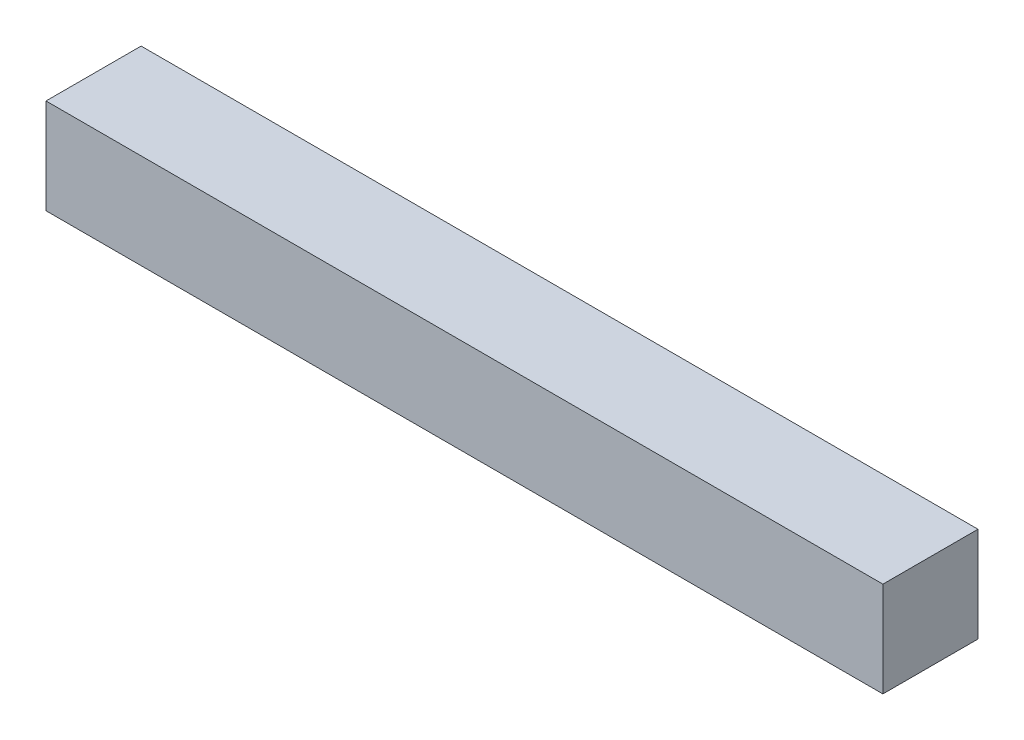
ISO-10303-21;
HEADER;
FILE_DESCRIPTION(('STEP AP214'),'2;1');
FILE_NAME('part.step','',(''),(''),'','','');
FILE_SCHEMA(('AUTOMOTIVE_DESIGN { 1 0 10303 214 1 1 1 1 }'));
ENDSEC;
DATA;
#1=APPLICATION_CONTEXT('core data for automotive mechanical design processes');
#2=APPLICATION_PROTOCOL_DEFINITION('international standard','automotive_design',2000,#1);
#3=PRODUCT_CONTEXT('',#1,'mechanical');
#4=PRODUCT('Part','Part','',(#3));
#5=PRODUCT_RELATED_PRODUCT_CATEGORY('part','',(#4));
#6=PRODUCT_DEFINITION_FORMATION('','',#4);
#7=PRODUCT_DEFINITION_CONTEXT('part definition',#1,'design');
#8=PRODUCT_DEFINITION('design','',#6,#7);
#9=PRODUCT_DEFINITION_SHAPE('','',#8);
#10=(LENGTH_UNIT() NAMED_UNIT(*) SI_UNIT(.MILLI.,.METRE.));
#11=(NAMED_UNIT(*) PLANE_ANGLE_UNIT() SI_UNIT($,.RADIAN.));
#12=(NAMED_UNIT(*) SI_UNIT($,.STERADIAN.) SOLID_ANGLE_UNIT());
#13=UNCERTAINTY_MEASURE_WITH_UNIT(LENGTH_MEASURE(1.E-05),#10,'distance_accuracy_value','');
#14=(GEOMETRIC_REPRESENTATION_CONTEXT(3) GLOBAL_UNCERTAINTY_ASSIGNED_CONTEXT((#13)) GLOBAL_UNIT_ASSIGNED_CONTEXT((#10,
#11,#12)) REPRESENTATION_CONTEXT('',''));
#15=CARTESIAN_POINT('',(0.,0.,0.));
#16=DIRECTION('',(0.,0.,1.));
#17=DIRECTION('',(1.,0.,0.));
#18=AXIS2_PLACEMENT_3D('',#15,#16,#17);
#19=CARTESIAN_POINT('',(220.,-25.,50.));
#20=DIRECTION('',(-1.,0.,0.));
#21=DIRECTION('',(0.,0.,1.));
#22=AXIS2_PLACEMENT_3D('',#19,#20,#21);
#23=PLANE('',#22);
#24=DIRECTION('',(0.,1.,0.));
#25=VECTOR('',#24,1.);
#26=CARTESIAN_POINT('',(220.,-25.,0.));
#27=LINE('',#26,#25);
#28=CARTESIAN_POINT('',(220.,-25.,0.));
#29=VERTEX_POINT('',#28);
#30=CARTESIAN_POINT('',(220.,25.,0.));
#31=VERTEX_POINT('',#30);
#32=EDGE_CURVE('E96',#29,#31,#27,.T.);
#33=ORIENTED_EDGE('',*,*,#32,.T.);
#34=DIRECTION('',(0.,0.,-1.));
#35=VECTOR('',#34,1.);
#36=CARTESIAN_POINT('',(220.,25.,50.));
#37=LINE('',#36,#35);
#38=CARTESIAN_POINT('',(220.,25.,50.));
#39=VERTEX_POINT('',#38);
#40=EDGE_CURVE('E11',#39,#31,#37,.T.);
#41=ORIENTED_EDGE('',*,*,#40,.F.);
#42=DIRECTION('',(0.,1.,0.));
#43=VECTOR('',#42,1.);
#44=CARTESIAN_POINT('',(220.,-25.,50.));
#45=LINE('',#44,#43);
#46=CARTESIAN_POINT('',(220.,-25.,50.));
#47=VERTEX_POINT('',#46);
#48=EDGE_CURVE('E84',#47,#39,#45,.T.);
#49=ORIENTED_EDGE('',*,*,#48,.F.);
#50=DIRECTION('',(0.,0.,-1.));
#51=VECTOR('',#50,1.);
#52=CARTESIAN_POINT('',(220.,-25.,50.));
#53=LINE('',#52,#51);
#54=EDGE_CURVE('E92',#47,#29,#53,.T.);
#55=ORIENTED_EDGE('',*,*,#54,.T.);
#56=EDGE_LOOP('',(#33,#41,#49,#55));
#57=FACE_BOUND('',#56,.T.);
#58=ADVANCED_FACE('F33',(#57),#23,.F.);
#59=CARTESIAN_POINT('',(-220.,25.,50.));
#60=DIRECTION('',(0.,-1.,0.));
#61=DIRECTION('',(0.,0.,-1.));
#62=AXIS2_PLACEMENT_3D('',#59,#60,#61);
#63=PLANE('',#62);
#64=DIRECTION('',(-1.,0.,0.));
#65=VECTOR('',#64,1.);
#66=CARTESIAN_POINT('',(-220.,25.,0.));
#67=LINE('',#66,#65);
#68=CARTESIAN_POINT('',(-220.,25.,0.));
#69=VERTEX_POINT('',#68);
#70=EDGE_CURVE('E88',#31,#69,#67,.T.);
#71=ORIENTED_EDGE('',*,*,#70,.T.);
#72=DIRECTION('',(0.,0.,-1.));
#73=VECTOR('',#72,1.);
#74=CARTESIAN_POINT('',(-220.,25.,50.));
#75=LINE('',#74,#73);
#76=CARTESIAN_POINT('',(-220.,25.,50.));
#77=VERTEX_POINT('',#76);
#78=EDGE_CURVE('E41',#77,#69,#75,.T.);
#79=ORIENTED_EDGE('',*,*,#78,.F.);
#80=DIRECTION('',(-1.,0.,0.));
#81=VECTOR('',#80,1.);
#82=CARTESIAN_POINT('',(-220.,25.,50.));
#83=LINE('',#82,#81);
#84=EDGE_CURVE('E79',#39,#77,#83,.T.);
#85=ORIENTED_EDGE('',*,*,#84,.F.);
#86=ORIENTED_EDGE('',*,*,#40,.T.);
#87=EDGE_LOOP('',(#71,#79,#85,#86));
#88=FACE_BOUND('',#87,.T.);
#89=ADVANCED_FACE('F87',(#88),#63,.F.);
#90=CARTESIAN_POINT('',(-220.,-25.,50.));
#91=DIRECTION('',(1.,0.,0.));
#92=DIRECTION('',(0.,0.,-1.));
#93=AXIS2_PLACEMENT_3D('',#90,#91,#92);
#94=PLANE('',#93);
#95=DIRECTION('',(0.,-1.,0.));
#96=VECTOR('',#95,1.);
#97=CARTESIAN_POINT('',(-220.,-25.,0.));
#98=LINE('',#97,#96);
#99=CARTESIAN_POINT('',(-220.,-25.,0.));
#100=VERTEX_POINT('',#99);
#101=EDGE_CURVE('E66',#69,#100,#98,.T.);
#102=ORIENTED_EDGE('',*,*,#101,.T.);
#103=DIRECTION('',(0.,0.,-1.));
#104=VECTOR('',#103,1.);
#105=CARTESIAN_POINT('',(-220.,-25.,50.));
#106=LINE('',#105,#104);
#107=CARTESIAN_POINT('',(-220.,-25.,50.));
#108=VERTEX_POINT('',#107);
#109=EDGE_CURVE('E89',#108,#100,#106,.T.);
#110=ORIENTED_EDGE('',*,*,#109,.F.);
#111=DIRECTION('',(0.,-1.,0.));
#112=VECTOR('',#111,1.);
#113=CARTESIAN_POINT('',(-220.,-25.,50.));
#114=LINE('',#113,#112);
#115=EDGE_CURVE('E82',#77,#108,#114,.T.);
#116=ORIENTED_EDGE('',*,*,#115,.F.);
#117=ORIENTED_EDGE('',*,*,#78,.T.);
#118=EDGE_LOOP('',(#102,#110,#116,#117));
#119=FACE_BOUND('',#118,.T.);
#120=ADVANCED_FACE('F90',(#119),#94,.F.);
#121=CARTESIAN_POINT('',(-220.,-25.,50.));
#122=DIRECTION('',(0.,1.,0.));
#123=DIRECTION('',(0.,0.,1.));
#124=AXIS2_PLACEMENT_3D('',#121,#122,#123);
#125=PLANE('',#124);
#126=DIRECTION('',(1.,0.,0.));
#127=VECTOR('',#126,1.);
#128=CARTESIAN_POINT('',(-220.,-25.,0.));
#129=LINE('',#128,#127);
#130=EDGE_CURVE('E72',#100,#29,#129,.T.);
#131=ORIENTED_EDGE('',*,*,#130,.T.);
#132=ORIENTED_EDGE('',*,*,#54,.F.);
#133=DIRECTION('',(1.,0.,0.));
#134=VECTOR('',#133,1.);
#135=CARTESIAN_POINT('',(-220.,-25.,50.));
#136=LINE('',#135,#134);
#137=EDGE_CURVE('E49',#108,#47,#136,.T.);
#138=ORIENTED_EDGE('',*,*,#137,.F.);
#139=ORIENTED_EDGE('',*,*,#109,.T.);
#140=EDGE_LOOP('',(#131,#132,#138,#139));
#141=FACE_BOUND('',#140,.T.);
#142=ADVANCED_FACE('F103',(#141),#125,.F.);
#143=CARTESIAN_POINT('',(0.,0.,50.));
#144=DIRECTION('',(0.,0.,-1.));
#145=DIRECTION('',(-1.,0.,0.));
#146=AXIS2_PLACEMENT_3D('',#143,#144,#145);
#147=PLANE('',#146);
#148=ORIENTED_EDGE('',*,*,#48,.T.);
#149=ORIENTED_EDGE('',*,*,#84,.T.);
#150=ORIENTED_EDGE('',*,*,#115,.T.);
#151=ORIENTED_EDGE('',*,*,#137,.T.);
#152=EDGE_LOOP('',(#148,#149,#150,#151));
#153=FACE_BOUND('',#152,.T.);
#154=ADVANCED_FACE('F80',(#153),#147,.F.);
#155=CARTESIAN_POINT('',(0.,0.,0.));
#156=DIRECTION('',(0.,0.,-1.));
#157=DIRECTION('',(-1.,0.,0.));
#158=AXIS2_PLACEMENT_3D('',#155,#156,#157);
#159=PLANE('',#158);
#160=ORIENTED_EDGE('',*,*,#32,.F.);
#161=ORIENTED_EDGE('',*,*,#130,.F.);
#162=ORIENTED_EDGE('',*,*,#101,.F.);
#163=ORIENTED_EDGE('',*,*,#70,.F.);
#164=EDGE_LOOP('',(#160,#161,#162,#163));
#165=FACE_BOUND('',#164,.T.);
#166=ADVANCED_FACE('F106',(#165),#159,.T.);
#167=CLOSED_SHELL('',(#58,#89,#120,#142,#154,#166));
#168=MANIFOLD_SOLID_BREP('B2',#167);
#169=ADVANCED_BREP_SHAPE_REPRESENTATION('',(#18,#168),#14);
#170=SHAPE_DEFINITION_REPRESENTATION(#9,#169);
ENDSEC;
END-ISO-10303-21;
